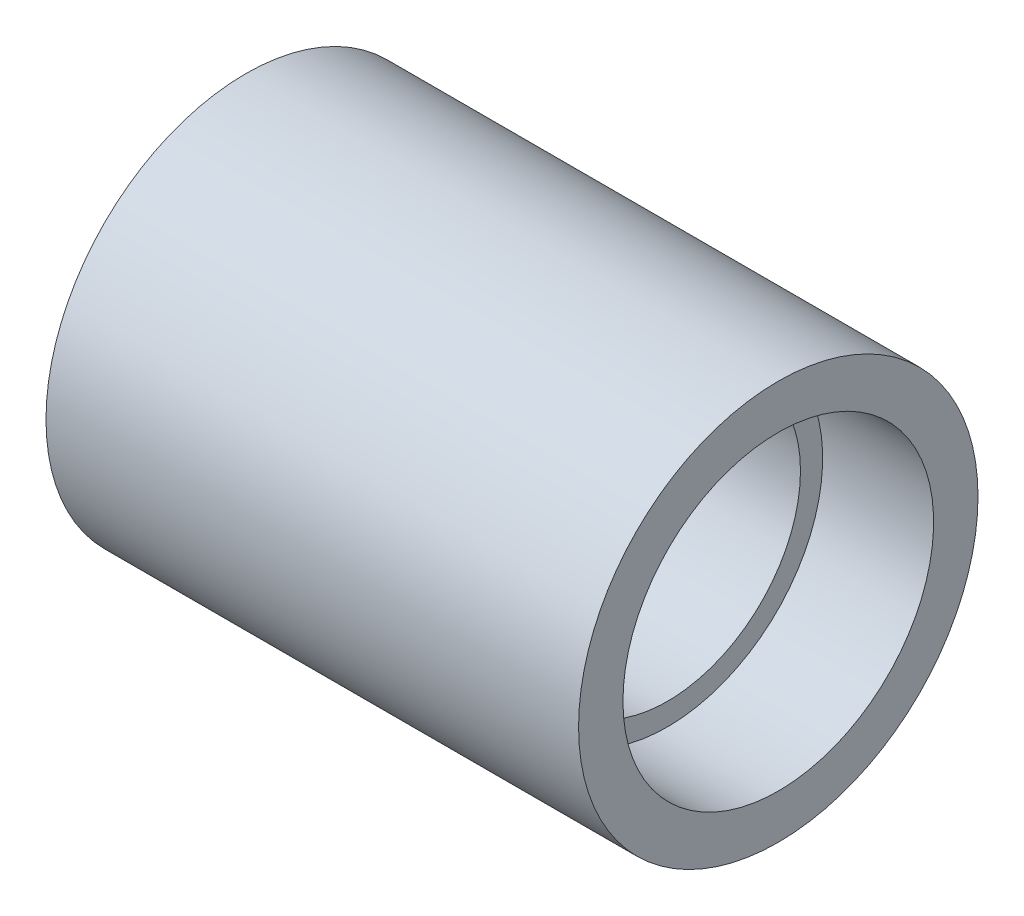
ISO-10303-21;
HEADER;
FILE_DESCRIPTION(('STEP AP214'),'2;1');
FILE_NAME('part.step','',(''),(''),'','','');
FILE_SCHEMA(('AUTOMOTIVE_DESIGN { 1 0 10303 214 1 1 1 1 }'));
ENDSEC;
DATA;
#1=APPLICATION_CONTEXT('core data for automotive mechanical design processes');
#2=APPLICATION_PROTOCOL_DEFINITION('international standard','automotive_design',2000,#1);
#3=PRODUCT_CONTEXT('',#1,'mechanical');
#4=PRODUCT('Part','Part','',(#3));
#5=PRODUCT_RELATED_PRODUCT_CATEGORY('part','',(#4));
#6=PRODUCT_DEFINITION_FORMATION('','',#4);
#7=PRODUCT_DEFINITION_CONTEXT('part definition',#1,'design');
#8=PRODUCT_DEFINITION('design','',#6,#7);
#9=PRODUCT_DEFINITION_SHAPE('','',#8);
#10=(LENGTH_UNIT() NAMED_UNIT(*) SI_UNIT(.MILLI.,.METRE.));
#11=(NAMED_UNIT(*) PLANE_ANGLE_UNIT() SI_UNIT($,.RADIAN.));
#12=(NAMED_UNIT(*) SI_UNIT($,.STERADIAN.) SOLID_ANGLE_UNIT());
#13=UNCERTAINTY_MEASURE_WITH_UNIT(LENGTH_MEASURE(1.E-05),#10,'distance_accuracy_value','');
#14=(GEOMETRIC_REPRESENTATION_CONTEXT(3) GLOBAL_UNCERTAINTY_ASSIGNED_CONTEXT((#13)) GLOBAL_UNIT_ASSIGNED_CONTEXT((#10,
#11,#12)) REPRESENTATION_CONTEXT('',''));
#15=CARTESIAN_POINT('',(0.,0.,0.));
#16=DIRECTION('',(0.,0.,1.));
#17=DIRECTION('',(1.,0.,0.));
#18=AXIS2_PLACEMENT_3D('',#15,#16,#17);
#19=CARTESIAN_POINT('',(-8.50805903611093,0.,0.));
#20=DIRECTION('',(-1.,0.,0.));
#21=DIRECTION('',(0.,0.,1.));
#22=AXIS2_PLACEMENT_3D('',#19,#20,#21);
#23=CYLINDRICAL_SURFACE('',#22,4.5);
#24=CARTESIAN_POINT('',(-6.,0.,0.));
#25=DIRECTION('',(-1.,0.,0.));
#26=DIRECTION('',(0.,0.,1.));
#27=AXIS2_PLACEMENT_3D('',#24,#25,#26);
#28=CIRCLE('',#27,4.5);
#29=CARTESIAN_POINT('',(-6.,0.,4.5));
#30=VERTEX_POINT('',#29);
#31=EDGE_CURVE('E10',#30,#30,#28,.T.);
#32=ORIENTED_EDGE('',*,*,#31,.F.);
#33=EDGE_LOOP('',(#32));
#34=FACE_BOUND('',#33,.T.);
#35=CARTESIAN_POINT('',(6.,0.,0.));
#36=DIRECTION('',(-1.,0.,0.));
#37=DIRECTION('',(0.,0.,1.));
#38=AXIS2_PLACEMENT_3D('',#35,#36,#37);
#39=CIRCLE('',#38,4.5);
#40=CARTESIAN_POINT('',(6.,0.,4.5));
#41=VERTEX_POINT('',#40);
#42=EDGE_CURVE('E59',#41,#41,#39,.T.);
#43=ORIENTED_EDGE('',*,*,#42,.T.);
#44=EDGE_LOOP('',(#43));
#45=FACE_BOUND('',#44,.T.);
#46=ADVANCED_FACE('F31',(#34,#45),#23,.T.);
#47=CARTESIAN_POINT('',(-6.,4.5,0.));
#48=DIRECTION('',(1.,0.,0.));
#49=DIRECTION('',(0.,0.,-1.));
#50=AXIS2_PLACEMENT_3D('',#47,#48,#49);
#51=PLANE('',#50);
#52=CARTESIAN_POINT('',(-6.,0.,0.));
#53=DIRECTION('',(-1.,0.,0.));
#54=DIRECTION('',(0.,0.,1.));
#55=AXIS2_PLACEMENT_3D('',#52,#53,#54);
#56=CIRCLE('',#55,3.5);
#57=CARTESIAN_POINT('',(-6.,0.,3.5));
#58=VERTEX_POINT('',#57);
#59=EDGE_CURVE('E37',#58,#58,#56,.T.);
#60=ORIENTED_EDGE('',*,*,#59,.F.);
#61=EDGE_LOOP('',(#60));
#62=FACE_BOUND('',#61,.T.);
#63=ORIENTED_EDGE('',*,*,#31,.T.);
#64=EDGE_LOOP('',(#63));
#65=FACE_BOUND('',#64,.T.);
#66=ADVANCED_FACE('F96',(#62,#65),#51,.F.);
#67=CARTESIAN_POINT('',(-8.50805903611093,0.,0.));
#68=DIRECTION('',(-1.,0.,0.));
#69=DIRECTION('',(0.,0.,1.));
#70=AXIS2_PLACEMENT_3D('',#67,#68,#69);
#71=CYLINDRICAL_SURFACE('',#70,3.5);
#72=CARTESIAN_POINT('',(-3.5,0.,0.));
#73=DIRECTION('',(-1.,0.,0.));
#74=DIRECTION('',(0.,0.,1.));
#75=AXIS2_PLACEMENT_3D('',#72,#73,#74);
#76=CIRCLE('',#75,3.5);
#77=CARTESIAN_POINT('',(-3.5,0.,3.5));
#78=VERTEX_POINT('',#77);
#79=EDGE_CURVE('E41',#78,#78,#76,.T.);
#80=ORIENTED_EDGE('',*,*,#79,.F.);
#81=EDGE_LOOP('',(#80));
#82=FACE_BOUND('',#81,.T.);
#83=ORIENTED_EDGE('',*,*,#59,.T.);
#84=EDGE_LOOP('',(#83));
#85=FACE_BOUND('',#84,.T.);
#86=ADVANCED_FACE('F91',(#82,#85),#71,.F.);
#87=CARTESIAN_POINT('',(-3.5,3.5,0.));
#88=DIRECTION('',(1.,0.,0.));
#89=DIRECTION('',(0.,0.,-1.));
#90=AXIS2_PLACEMENT_3D('',#87,#88,#89);
#91=PLANE('',#90);
#92=CARTESIAN_POINT('',(-3.5,0.,0.));
#93=DIRECTION('',(-1.,0.,0.));
#94=DIRECTION('',(0.,0.,1.));
#95=AXIS2_PLACEMENT_3D('',#92,#93,#94);
#96=CIRCLE('',#95,3.);
#97=CARTESIAN_POINT('',(-3.5,0.,3.));
#98=VERTEX_POINT('',#97);
#99=EDGE_CURVE('E45',#98,#98,#96,.T.);
#100=ORIENTED_EDGE('',*,*,#99,.F.);
#101=EDGE_LOOP('',(#100));
#102=FACE_BOUND('',#101,.T.);
#103=ORIENTED_EDGE('',*,*,#79,.T.);
#104=EDGE_LOOP('',(#103));
#105=FACE_BOUND('',#104,.T.);
#106=ADVANCED_FACE('F85',(#102,#105),#91,.F.);
#107=CARTESIAN_POINT('',(-8.50805903611093,0.,0.));
#108=DIRECTION('',(-1.,0.,0.));
#109=DIRECTION('',(0.,0.,1.));
#110=AXIS2_PLACEMENT_3D('',#107,#108,#109);
#111=CYLINDRICAL_SURFACE('',#110,3.);
#112=CARTESIAN_POINT('',(3.5,0.,0.));
#113=DIRECTION('',(-1.,0.,0.));
#114=DIRECTION('',(0.,0.,1.));
#115=AXIS2_PLACEMENT_3D('',#112,#113,#114);
#116=CIRCLE('',#115,3.);
#117=CARTESIAN_POINT('',(3.5,0.,3.));
#118=VERTEX_POINT('',#117);
#119=EDGE_CURVE('E50',#118,#118,#116,.T.);
#120=ORIENTED_EDGE('',*,*,#119,.F.);
#121=EDGE_LOOP('',(#120));
#122=FACE_BOUND('',#121,.T.);
#123=ORIENTED_EDGE('',*,*,#99,.T.);
#124=EDGE_LOOP('',(#123));
#125=FACE_BOUND('',#124,.T.);
#126=ADVANCED_FACE('F79',(#122,#125),#111,.F.);
#127=CARTESIAN_POINT('',(3.5,3.,0.));
#128=DIRECTION('',(-1.,0.,0.));
#129=DIRECTION('',(0.,0.,1.));
#130=AXIS2_PLACEMENT_3D('',#127,#128,#129);
#131=PLANE('',#130);
#132=CARTESIAN_POINT('',(3.5,0.,0.));
#133=DIRECTION('',(-1.,0.,0.));
#134=DIRECTION('',(0.,0.,1.));
#135=AXIS2_PLACEMENT_3D('',#132,#133,#134);
#136=CIRCLE('',#135,3.5);
#137=CARTESIAN_POINT('',(3.5,0.,3.5));
#138=VERTEX_POINT('',#137);
#139=EDGE_CURVE('E53',#138,#138,#136,.T.);
#140=ORIENTED_EDGE('',*,*,#139,.F.);
#141=EDGE_LOOP('',(#140));
#142=FACE_BOUND('',#141,.T.);
#143=ORIENTED_EDGE('',*,*,#119,.T.);
#144=EDGE_LOOP('',(#143));
#145=FACE_BOUND('',#144,.T.);
#146=ADVANCED_FACE('F73',(#142,#145),#131,.F.);
#147=CARTESIAN_POINT('',(-8.50805903611093,0.,0.));
#148=DIRECTION('',(-1.,0.,0.));
#149=DIRECTION('',(0.,0.,1.));
#150=AXIS2_PLACEMENT_3D('',#147,#148,#149);
#151=CYLINDRICAL_SURFACE('',#150,3.5);
#152=CARTESIAN_POINT('',(6.,0.,0.));
#153=DIRECTION('',(-1.,0.,0.));
#154=DIRECTION('',(0.,0.,1.));
#155=AXIS2_PLACEMENT_3D('',#152,#153,#154);
#156=CIRCLE('',#155,3.5);
#157=CARTESIAN_POINT('',(6.,0.,3.5));
#158=VERTEX_POINT('',#157);
#159=EDGE_CURVE('E56',#158,#158,#156,.T.);
#160=ORIENTED_EDGE('',*,*,#159,.F.);
#161=EDGE_LOOP('',(#160));
#162=FACE_BOUND('',#161,.T.);
#163=ORIENTED_EDGE('',*,*,#139,.T.);
#164=EDGE_LOOP('',(#163));
#165=FACE_BOUND('',#164,.T.);
#166=ADVANCED_FACE('F67',(#162,#165),#151,.F.);
#167=CARTESIAN_POINT('',(6.,3.5,0.));
#168=DIRECTION('',(-1.,0.,0.));
#169=DIRECTION('',(0.,0.,1.));
#170=AXIS2_PLACEMENT_3D('',#167,#168,#169);
#171=PLANE('',#170);
#172=ORIENTED_EDGE('',*,*,#42,.F.);
#173=EDGE_LOOP('',(#172));
#174=FACE_BOUND('',#173,.T.);
#175=ORIENTED_EDGE('',*,*,#159,.T.);
#176=EDGE_LOOP('',(#175));
#177=FACE_BOUND('',#176,.T.);
#178=ADVANCED_FACE('F64',(#174,#177),#171,.F.);
#179=CLOSED_SHELL('',(#46,#66,#86,#106,#126,#146,#166,#178));
#180=MANIFOLD_SOLID_BREP('B2',#179);
#181=ADVANCED_BREP_SHAPE_REPRESENTATION('',(#18,#180),#14);
#182=SHAPE_DEFINITION_REPRESENTATION(#9,#181);
ENDSEC;
END-ISO-10303-21;
